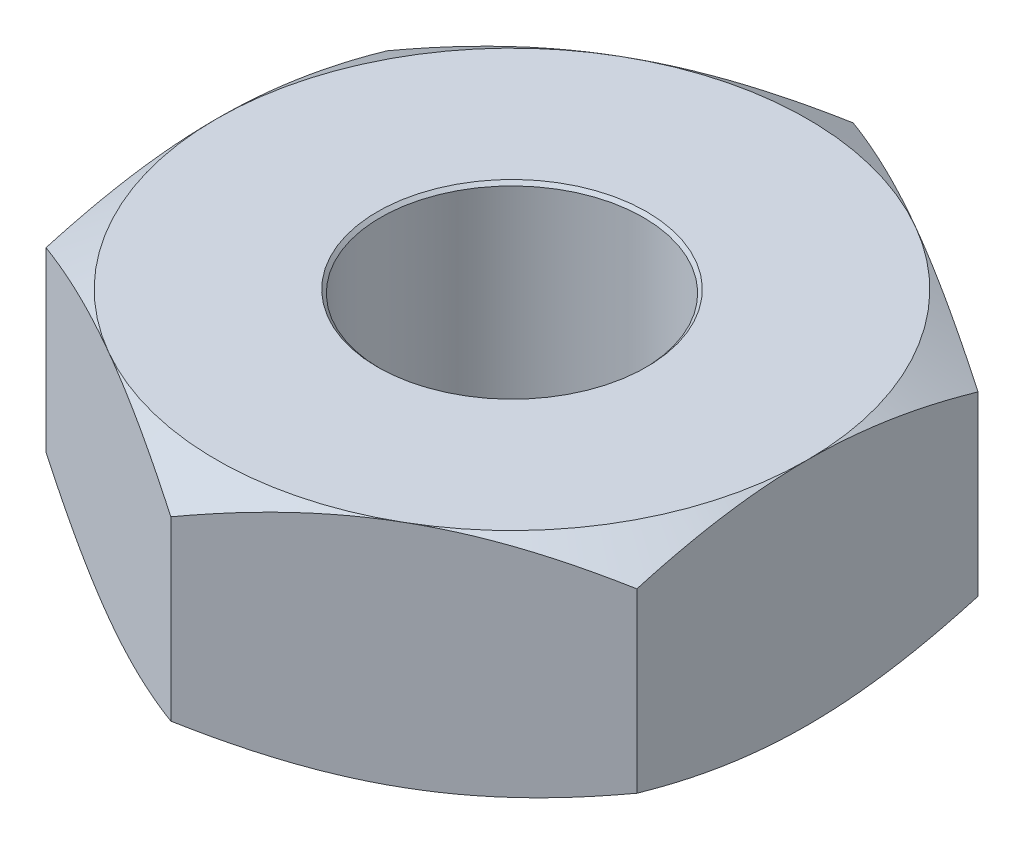
ISO-10303-21;
HEADER;
FILE_DESCRIPTION(('STEP AP214'),'2;1');
FILE_NAME('part.step','',(''),(''),'','','');
FILE_SCHEMA(('AUTOMOTIVE_DESIGN { 1 0 10303 214 1 1 1 1 }'));
ENDSEC;
DATA;
#1=APPLICATION_CONTEXT('core data for automotive mechanical design processes');
#2=APPLICATION_PROTOCOL_DEFINITION('international standard','automotive_design',2000,#1);
#3=PRODUCT_CONTEXT('',#1,'mechanical');
#4=PRODUCT('Part','Part','',(#3));
#5=PRODUCT_RELATED_PRODUCT_CATEGORY('part','',(#4));
#6=PRODUCT_DEFINITION_FORMATION('','',#4);
#7=PRODUCT_DEFINITION_CONTEXT('part definition',#1,'design');
#8=PRODUCT_DEFINITION('design','',#6,#7);
#9=PRODUCT_DEFINITION_SHAPE('','',#8);
#10=(LENGTH_UNIT() NAMED_UNIT(*) SI_UNIT(.MILLI.,.METRE.));
#11=(NAMED_UNIT(*) PLANE_ANGLE_UNIT() SI_UNIT($,.RADIAN.));
#12=(NAMED_UNIT(*) SI_UNIT($,.STERADIAN.) SOLID_ANGLE_UNIT());
#13=UNCERTAINTY_MEASURE_WITH_UNIT(LENGTH_MEASURE(1.E-05),#10,'distance_accuracy_value','');
#14=(GEOMETRIC_REPRESENTATION_CONTEXT(3) GLOBAL_UNCERTAINTY_ASSIGNED_CONTEXT((#13)) GLOBAL_UNIT_ASSIGNED_CONTEXT((#10,
#11,#12)) REPRESENTATION_CONTEXT('',''));
#15=CARTESIAN_POINT('',(0.,0.,0.));
#16=DIRECTION('',(0.,0.,1.));
#17=DIRECTION('',(1.,0.,0.));
#18=AXIS2_PLACEMENT_3D('',#15,#16,#17);
#19=CARTESIAN_POINT('',(-2.24999999999997,1.75,1.29903810567668));
#20=DIRECTION('',(0.499999999999995,0.,-0.866025403784442));
#21=DIRECTION('',(-0.866025403784442,0.,-0.499999999999995));
#22=AXIS2_PLACEMENT_3D('',#19,#20,#21);
#23=PLANE('',#22);
#24=CARTESIAN_POINT('',(0.0002,0.201028565434247,2.59819168140714));
#25=CARTESIAN_POINT('',(-0.0986772488143572,0.168055578047857,2.54110487518744));
#26=CARTESIAN_POINT('',(-0.198407997179093,0.138067535415591,2.48352530077258));
#27=CARTESIAN_POINT('',(-0.399596540220632,0.0857223882308722,2.36736904128968));
#28=CARTESIAN_POINT('',(-0.501057910502945,0.0633838027064733,2.30879029184484));
#29=CARTESIAN_POINT('',(-0.702723189801078,0.0286095576734145,2.19235878855586));
#30=CARTESIAN_POINT('',(-0.802896064976671,0.0159424738337146,2.13452395210774));
#31=CARTESIAN_POINT('',(-1.00371331260268,0.000818907417416121,2.01858206013294));
#32=CARTESIAN_POINT('',(-1.1043569548332,-0.00165009697600391,1.96047542619893));
#33=CARTESIAN_POINT('',(-1.29242516452656,0.00347837463602749,1.85189419470646));
#34=CARTESIAN_POINT('',(-1.37987784389125,0.0098166345151186,1.8014033667339));
#35=CARTESIAN_POINT('',(-1.55421343210876,0.029907657189887,1.70075066794719));
#36=CARTESIAN_POINT('',(-1.64109573768828,0.0436672872310812,1.65058914543304));
#37=CARTESIAN_POINT('',(-1.81579095410172,0.078066265350662,1.5497288152106));
#38=CARTESIAN_POINT('',(-1.90358174743524,0.0988514715826513,1.49904277704713));
#39=CARTESIAN_POINT('',(-2.07785373687757,0.146026087362973,1.39842679703038));
#40=CARTESIAN_POINT('',(-2.16433716675098,0.172404408014295,1.34849556551253));
#41=CARTESIAN_POINT('',(-2.25019999999997,0.201028565434247,1.29892263562284));
#42=B_SPLINE_CURVE_WITH_KNOTS('',3,(#24,#25,#26,#27,#28,#29,#30,#31,#32,#33,#34,#35,#36,#37,#38,
#39,#40,#41),.UNSPECIFIED.,.F.,.F.,(4,2,2,2,2,2,2,2,4),(0.,0.35665882601655,0.714175103224232,
1.06284241804968,1.41108149062515,1.71433394539792,2.0178674925822,2.32813511279242,
2.63779325460355),.UNSPECIFIED.);
#43=CARTESIAN_POINT('',(0.,0.200961894323333,2.5980762113533));
#44=VERTEX_POINT('',#43);
#45=CARTESIAN_POINT('',(-1.12499999999999,0.,1.94855715851499));
#46=VERTEX_POINT('',#45);
#47=EDGE_CURVE('E153',#44,#46,#42,.T.);
#48=ORIENTED_EDGE('',*,*,#47,.F.);
#49=DIRECTION('',(0.,-1.,0.));
#50=VECTOR('',#49,1.);
#51=CARTESIAN_POINT('',(0.,1.75,2.5980762113533));
#52=LINE('',#51,#50);
#53=CARTESIAN_POINT('',(0.,1.54903810567667,2.5980762113533));
#54=VERTEX_POINT('',#53);
#55=EDGE_CURVE('E168',#54,#44,#52,.T.);
#56=ORIENTED_EDGE('',*,*,#55,.F.);
#57=CARTESIAN_POINT('',(-2.25019999999997,1.54897143456575,1.29892263562284));
#58=CARTESIAN_POINT('',(-2.15132275118562,1.58194442195214,1.35600944184254));
#59=CARTESIAN_POINT('',(-2.05159200282088,1.61193246458441,1.4135890162574));
#60=CARTESIAN_POINT('',(-1.85040345977934,1.66427761176913,1.5297452757403));
#61=CARTESIAN_POINT('',(-1.74894208949703,1.68661619729353,1.58832402518514));
#62=CARTESIAN_POINT('',(-1.5472768101989,1.72139044232659,1.70475552847412));
#63=CARTESIAN_POINT('',(-1.4471039350233,1.73405752616629,1.76259036492224));
#64=CARTESIAN_POINT('',(-1.2462866873973,1.74918109258258,1.87853225689704));
#65=CARTESIAN_POINT('',(-1.14564304516677,1.751650096976,1.93663889083105));
#66=CARTESIAN_POINT('',(-0.957574835473412,1.74652162536397,2.04522012232352));
#67=CARTESIAN_POINT('',(-0.870122156108721,1.74018336548488,2.09571095029608));
#68=CARTESIAN_POINT('',(-0.695786567891209,1.72009234281011,2.19636364908279));
#69=CARTESIAN_POINT('',(-0.608904262311697,1.70633271276892,2.24652517159694));
#70=CARTESIAN_POINT('',(-0.434209045898254,1.67193373464934,2.34738550181938));
#71=CARTESIAN_POINT('',(-0.346418252564738,1.65114852841735,2.39807153998285));
#72=CARTESIAN_POINT('',(-0.172146263122401,1.60397391263703,2.4986875199996));
#73=CARTESIAN_POINT('',(-0.0856628332489957,1.5775955919857,2.54861875151745));
#74=CARTESIAN_POINT('',(0.000199999999999916,1.54897143456575,2.59819168140714));
#75=B_SPLINE_CURVE_WITH_KNOTS('',3,(#57,#58,#59,#60,#61,#62,#63,#64,#65,#66,#67,#68,#69,#70,#71,
#72,#73,#74),.UNSPECIFIED.,.F.,.F.,(4,2,2,2,2,2,2,2,4),(0.,0.35665882601655,0.714175103224233,
1.06284241804968,1.41108149062515,1.71433394539792,2.0178674925822,2.32813511279242,
2.63779325460355),.UNSPECIFIED.);
#76=CARTESIAN_POINT('',(-1.12499999999999,1.75,1.94855715851499));
#77=VERTEX_POINT('',#76);
#78=EDGE_CURVE('E232',#77,#54,#75,.T.);
#79=ORIENTED_EDGE('',*,*,#78,.F.);
#80=CARTESIAN_POINT('',(-2.24999999999997,1.54903810567667,1.29903810567668));
#81=VERTEX_POINT('',#80);
#82=EDGE_CURVE('E239',#81,#77,#75,.T.);
#83=ORIENTED_EDGE('',*,*,#82,.F.);
#84=DIRECTION('',(0.,-1.,0.));
#85=VECTOR('',#84,1.);
#86=CARTESIAN_POINT('',(-2.24999999999997,1.75,1.29903810567668));
#87=LINE('',#86,#85);
#88=CARTESIAN_POINT('',(-2.24999999999997,0.200961894323333,1.29903810567668));
#89=VERTEX_POINT('',#88);
#90=EDGE_CURVE('E247',#81,#89,#87,.T.);
#91=ORIENTED_EDGE('',*,*,#90,.T.);
#92=EDGE_CURVE('E221',#46,#89,#42,.T.);
#93=ORIENTED_EDGE('',*,*,#92,.F.);
#94=EDGE_LOOP('',(#48,#56,#79,#83,#91,#93));
#95=FACE_BOUND('',#94,.T.);
#96=ADVANCED_FACE('F43',(#95),#23,.F.);
#97=CARTESIAN_POINT('',(0.,1.75,2.5980762113533));
#98=DIRECTION('',(-0.500000000000001,0.,-0.866025403784438));
#99=DIRECTION('',(-0.866025403784438,0.,0.500000000000001));
#100=AXIS2_PLACEMENT_3D('',#97,#98,#99);
#101=PLANE('',#100);
#102=CARTESIAN_POINT('',(2.25019999999999,0.201028565434247,1.29892263562281));
#103=CARTESIAN_POINT('',(2.15132275118563,0.168055578047856,1.35600944184251));
#104=CARTESIAN_POINT('',(2.0515920028209,0.138067535415591,1.41358901625737));
#105=CARTESIAN_POINT('',(1.85040345977936,0.0857223882308706,1.52974527574027));
#106=CARTESIAN_POINT('',(1.74894208949705,0.0633838027064712,1.58832402518511));
#107=CARTESIAN_POINT('',(1.54727681019892,0.0286095576734114,1.70475552847409));
#108=CARTESIAN_POINT('',(1.44710393502332,0.0159424738337108,1.76259036492222));
#109=CARTESIAN_POINT('',(1.24628668739732,0.000818907417411258,1.87853225689701));
#110=CARTESIAN_POINT('',(1.1456430451668,-0.00165009697600925,1.93663889083103));
#111=CARTESIAN_POINT('',(0.957574835473434,0.00347837463602143,2.0452201223235));
#112=CARTESIAN_POINT('',(0.870122156108741,0.0098166345151125,2.09571095029606));
#113=CARTESIAN_POINT('',(0.695786567891225,0.0299076571898813,2.19636364908278));
#114=CARTESIAN_POINT('',(0.608904262311711,0.0436672872310758,2.24652517159692));
#115=CARTESIAN_POINT('',(0.434209045898263,0.0780662653506577,2.34738550181937));
#116=CARTESIAN_POINT('',(0.346418252564746,0.0988514715826477,2.39807153998285));
#117=CARTESIAN_POINT('',(0.172146263122404,0.146026087362971,2.49868751999959));
#118=CARTESIAN_POINT('',(0.0856628332489972,0.172404408014294,2.54861875151745));
#119=CARTESIAN_POINT('',(-0.000200000000000304,0.201028565434247,2.59819168140714));
#120=B_SPLINE_CURVE_WITH_KNOTS('',3,(#102,#103,#104,#105,#106,#107,#108,#109,#110,#111,#112,
#113,#114,#115,#116,#117,#118,#119),.UNSPECIFIED.,.F.,.F.,(4,2,2,2,2,2,2,2,4),(0.,
0.35665882601655,0.714175103224233,1.06284241804968,1.41108149062515,1.71433394539793,
2.01786749258221,2.32813511279244,2.63779325460359),.UNSPECIFIED.);
#121=CARTESIAN_POINT('',(2.24999999999999,0.200961894323333,1.29903810567665));
#122=VERTEX_POINT('',#121);
#123=CARTESIAN_POINT('',(1.125,0.,1.94855715851499));
#124=VERTEX_POINT('',#123);
#125=EDGE_CURVE('E132',#122,#124,#120,.T.);
#126=ORIENTED_EDGE('',*,*,#125,.F.);
#127=DIRECTION('',(0.,-1.,0.));
#128=VECTOR('',#127,1.);
#129=CARTESIAN_POINT('',(2.24999999999999,1.75,1.29903810567665));
#130=LINE('',#129,#128);
#131=CARTESIAN_POINT('',(2.24999999999999,1.54903810567667,1.29903810567665));
#132=VERTEX_POINT('',#131);
#133=EDGE_CURVE('E259',#132,#122,#130,.T.);
#134=ORIENTED_EDGE('',*,*,#133,.F.);
#135=CARTESIAN_POINT('',(-0.000200000000000074,1.54897143456575,2.59819168140714));
#136=CARTESIAN_POINT('',(0.0986772488143567,1.58194442195214,2.54110487518744));
#137=CARTESIAN_POINT('',(0.198407997179092,1.61193246458441,2.48352530077258));
#138=CARTESIAN_POINT('',(0.39959654022063,1.66427761176913,2.36736904128968));
#139=CARTESIAN_POINT('',(0.501057910502942,1.68661619729353,2.30879029184484));
#140=CARTESIAN_POINT('',(0.702723189801074,1.72139044232659,2.19235878855586));
#141=CARTESIAN_POINT('',(0.802896064976667,1.73405752616629,2.13452395210773));
#142=CARTESIAN_POINT('',(1.00371331260267,1.74918109258259,2.01858206013294));
#143=CARTESIAN_POINT('',(1.10435695483319,1.75165009697601,1.96047542619892));
#144=CARTESIAN_POINT('',(1.29242516452656,1.74652162536398,1.85189419470645));
#145=CARTESIAN_POINT('',(1.37987784389125,1.74018336548489,1.80140336673389));
#146=CARTESIAN_POINT('',(1.55421343210877,1.72009234281012,1.70075066794717));
#147=CARTESIAN_POINT('',(1.64109573768828,1.70633271276892,1.65058914543302));
#148=CARTESIAN_POINT('',(1.81579095410173,1.67193373464934,1.54972881521058));
#149=CARTESIAN_POINT('',(1.90358174743524,1.65114852841735,1.4990427770471));
#150=CARTESIAN_POINT('',(2.07785373687759,1.60397391263703,1.39842679703035));
#151=CARTESIAN_POINT('',(2.16433716675099,1.57759559198571,1.3484955655125));
#152=CARTESIAN_POINT('',(2.25019999999999,1.54897143456575,1.29892263562281));
#153=B_SPLINE_CURVE_WITH_KNOTS('',3,(#135,#136,#137,#138,#139,#140,#141,#142,#143,#144,#145,
#146,#147,#148,#149,#150,#151,#152),.UNSPECIFIED.,.F.,.F.,(4,2,2,2,2,2,2,2,4),(0.,
0.35665882601655,0.714175103224232,1.06284241804968,1.41108149062515,1.71433394539793,
2.01786749258221,2.32813511279244,2.63779325460359),.UNSPECIFIED.);
#154=CARTESIAN_POINT('',(1.125,1.75,1.94855715851497));
#155=VERTEX_POINT('',#154);
#156=EDGE_CURVE('E241',#155,#132,#153,.T.);
#157=ORIENTED_EDGE('',*,*,#156,.F.);
#158=EDGE_CURVE('E240',#54,#155,#153,.T.);
#159=ORIENTED_EDGE('',*,*,#158,.F.);
#160=ORIENTED_EDGE('',*,*,#55,.T.);
#161=EDGE_CURVE('E145',#124,#44,#120,.T.);
#162=ORIENTED_EDGE('',*,*,#161,.F.);
#163=EDGE_LOOP('',(#126,#134,#157,#159,#160,#162));
#164=FACE_BOUND('',#163,.T.);
#165=ADVANCED_FACE('F165',(#164),#101,.F.);
#166=CARTESIAN_POINT('',(2.24999999999999,1.75,1.29903810567665));
#167=DIRECTION('',(-1.,0.,0.));
#168=DIRECTION('',(0.,0.,1.));
#169=AXIS2_PLACEMENT_3D('',#166,#167,#168);
#170=PLANE('',#169);
#171=CARTESIAN_POINT('',(2.24999999999997,1.12189345440879,-3.53839354168716));
#172=CARTESIAN_POINT('',(2.24999999999997,1.07381689263271,-3.43968702230924));
#173=CARTESIAN_POINT('',(2.24999999999997,1.02618738662809,-3.34075908734806));
#174=CARTESIAN_POINT('',(2.24999999999998,0.932073016159549,-3.14234279687417));
#175=CARTESIAN_POINT('',(2.24999999999998,0.885588323028845,-3.04285436018147));
#176=CARTESIAN_POINT('',(2.24999999999998,0.793790693187942,-2.84271015577662));
#177=CARTESIAN_POINT('',(2.24999999999998,0.748485099940266,-2.74205100864245));
#178=CARTESIAN_POINT('',(2.24999999999998,0.659663985324698,-2.53994893284405));
#179=CARTESIAN_POINT('',(2.24999999999998,0.616148382486699,-2.43850604010161));
#180=CARTESIAN_POINT('',(2.24999999999998,0.529951137913691,-2.23124359203539));
#181=CARTESIAN_POINT('',(2.24999999999998,0.487346902181633,-2.12539167338407));
#182=CARTESIAN_POINT('',(2.24999999999998,0.405245804089762,-1.91246771968394));
#183=CARTESIAN_POINT('',(2.24999999999998,0.365749283405793,-1.80539555195302));
#184=CARTESIAN_POINT('',(2.24999999999998,0.290864517372069,-1.59004569346553));
#185=CARTESIAN_POINT('',(2.24999999999998,0.255468368389612,-1.48177077815462));
#186=CARTESIAN_POINT('',(2.24999999999998,0.189887529477515,-1.26366853351124));
#187=CARTESIAN_POINT('',(2.24999999999998,0.15970124962558,-1.15384168889745));
#188=CARTESIAN_POINT('',(2.24999999999998,0.106115988937838,-0.933179524691479));
#189=CARTESIAN_POINT('',(2.24999999999998,0.0826792213152491,-0.822353549743366));
#190=CARTESIAN_POINT('',(2.24999999999998,0.0438866636506034,-0.599273570543113));
#191=CARTESIAN_POINT('',(2.24999999999998,0.0285300017443114,-0.487019721701504));
#192=CARTESIAN_POINT('',(2.24999999999999,0.00732134437037383,-0.263130818473846));
#193=CARTESIAN_POINT('',(2.24999999999999,0.00134332663237845,-0.151508003795488));
#194=CARTESIAN_POINT('',(2.24999999999999,-0.000936284764426156,0.0718484062996929));
#195=CARTESIAN_POINT('',(2.24999999999999,0.00276227423309439,0.183582003436407));
#196=CARTESIAN_POINT('',(2.24999999999999,0.0168788328783875,0.371822826821483));
#197=CARTESIAN_POINT('',(2.24999999999999,0.0248616867557757,0.448525129865842));
#198=CARTESIAN_POINT('',(2.24999999999999,0.0449163776446814,0.601398348033987));
#199=CARTESIAN_POINT('',(2.24999999999999,0.0569887285740803,0.677569195142451));
#200=CARTESIAN_POINT('',(2.24999999999999,0.0987103717056496,0.905153855162318));
#201=CARTESIAN_POINT('',(2.24999999999999,0.133857793287038,1.05556400492303));
#202=CARTESIAN_POINT('',(2.24999999999999,0.215919885548329,1.35680852161716));
#203=CARTESIAN_POINT('',(2.24999999999999,0.263090938580733,1.5075702774342));
#204=CARTESIAN_POINT('',(2.24999999999999,0.339802085098616,1.73161049986243));
#205=CARTESIAN_POINT('',(2.24999999999999,0.366362625537712,1.80593454194757));
#206=CARTESIAN_POINT('',(2.24999999999999,0.421158989940176,1.95396145865595));
#207=CARTESIAN_POINT('',(2.24999999999999,0.449394776403708,2.02766434714137));
#208=CARTESIAN_POINT('',(2.24999999999999,0.527171372756205,2.22505032637719));
#209=CARTESIAN_POINT('',(2.24999999999999,0.578001808570474,2.34822421197225));
#210=CARTESIAN_POINT('',(2.25,0.682625518133925,2.59331188339526));
#211=CARTESIAN_POINT('',(2.25,0.736419105236454,2.71522553432805));
#212=CARTESIAN_POINT('',(2.25,0.846268378663506,2.95807643433748));
#213=CARTESIAN_POINT('',(2.25,0.90232483610627,3.07901333342826));
#214=CARTESIAN_POINT('',(2.25,1.0161709877414,3.32007010456904));
#215=CARTESIAN_POINT('',(2.25,1.07396073407334,3.44018995190748));
#216=CARTESIAN_POINT('',(2.25,1.24952088573151,3.79993711773053));
#217=CARTESIAN_POINT('',(2.25,1.36930993606161,4.03857803401961));
#218=CARTESIAN_POINT('',(2.25,1.61226693923144,4.51405815321574));
#219=CARTESIAN_POINT('',(2.25,1.73543419277131,4.75089771623574));
#220=CARTESIAN_POINT('',(2.25,1.97102942460597,5.19856341283825));
#221=CARTESIAN_POINT('',(2.25000000000001,2.08322765871285,5.40951066425596));
#222=CARTESIAN_POINT('',(2.25000000000001,2.30897975973365,5.83069376778987));
#223=CARTESIAN_POINT('',(2.25000000000001,2.42253370840339,6.04092957601152));
#224=CARTESIAN_POINT('',(2.25000000000001,2.65026914188523,6.46015664385467));
#225=CARTESIAN_POINT('',(2.25000000000001,2.76444729048546,6.66914971794764));
#226=CARTESIAN_POINT('',(2.25000000000001,2.99357534595144,7.08669136434773));
#227=CARTESIAN_POINT('',(2.25000000000001,3.10852519197529,7.29523997002844));
#228=CARTESIAN_POINT('',(2.25000000000001,3.22375587580559,7.50363220026119));
#229=B_SPLINE_CURVE_WITH_KNOTS('',3,(#171,#172,#173,#174,#175,#176,#177,#178,#179,#180,#181,
#182,#183,#184,#185,#186,#187,#188,#189,#190,#191,#192,#193,#194,#195,#196,#197,#198,#199,#200,
#201,#202,#203,#204,#205,#206,#207,#208,#209,#210,#211,#212,#213,#214,#215,#216,#217,#218,#219,
#220,#221,#222,#223,#224,#225,#226,#227,#228),.UNSPECIFIED.,.F.,.F.,(4,2,2,2,2,2,2,2,2,2,2,2,2,
2,2,2,2,2,2,2,2,2,2,2,2,2,2,2,4),(0.,0.329380472235185,0.658809943772019,0.989951131456091,
1.32107723077628,1.66335183979109,2.00566402755003,2.3473050112902,2.68884154964647,
3.02842709235433,3.36797598538851,3.70292198982515,4.03787327835528,4.26911278952257,
4.50038137082525,4.96314563151469,5.43675110565364,5.67351746013594,5.91027851667872,
6.30997151319744,6.7097068587137,7.10957959135647,7.50946436477794,8.31046895155574,
9.11130896070854,9.82808994405625,10.5449143731561,11.2593583460016,11.97374663738),.UNSPECIFIED.);
#230=CARTESIAN_POINT('',(2.24999999999998,0.200961894323333,-1.29903810567666));
#231=VERTEX_POINT('',#230);
#232=CARTESIAN_POINT('',(2.25,0.,0.));
#233=VERTEX_POINT('',#232);
#234=EDGE_CURVE('E58',#231,#233,#229,.T.);
#235=ORIENTED_EDGE('',*,*,#234,.F.);
#236=DIRECTION('',(0.,-1.,0.));
#237=VECTOR('',#236,1.);
#238=CARTESIAN_POINT('',(2.24999999999998,1.75,-1.29903810567666));
#239=LINE('',#238,#237);
#240=CARTESIAN_POINT('',(2.24999999999998,1.54903810567667,-1.29903810567666));
#241=VERTEX_POINT('',#240);
#242=EDGE_CURVE('E256',#241,#231,#239,.T.);
#243=ORIENTED_EDGE('',*,*,#242,.F.);
#244=CARTESIAN_POINT('',(2.24999999999997,0.628106545591214,-3.53839354168716));
#245=CARTESIAN_POINT('',(2.24999999999997,0.676183107367294,-3.43968702230924));
#246=CARTESIAN_POINT('',(2.24999999999997,0.723812613371908,-3.34075908734806));
#247=CARTESIAN_POINT('',(2.24999999999998,0.817926983840451,-3.14234279687417));
#248=CARTESIAN_POINT('',(2.24999999999998,0.864411676971154,-3.04285436018147));
#249=CARTESIAN_POINT('',(2.24999999999998,0.956209306812058,-2.84271015577662));
#250=CARTESIAN_POINT('',(2.24999999999998,1.00151490005973,-2.74205100864245));
#251=CARTESIAN_POINT('',(2.24999999999998,1.0903360146753,-2.53994893284405));
#252=CARTESIAN_POINT('',(2.24999999999998,1.1338516175133,-2.43850604010161));
#253=CARTESIAN_POINT('',(2.24999999999998,1.22004886208631,-2.23124359203539));
#254=CARTESIAN_POINT('',(2.24999999999998,1.26265309781837,-2.12539167338407));
#255=CARTESIAN_POINT('',(2.24999999999998,1.34475419591024,-1.91246771968394));
#256=CARTESIAN_POINT('',(2.24999999999998,1.38425071659421,-1.80539555195302));
#257=CARTESIAN_POINT('',(2.24999999999998,1.45913548262793,-1.59004569346553));
#258=CARTESIAN_POINT('',(2.24999999999998,1.49453163161039,-1.48177077815462));
#259=CARTESIAN_POINT('',(2.24999999999998,1.56011247052248,-1.26366853351124));
#260=CARTESIAN_POINT('',(2.24999999999998,1.59029875037442,-1.15384168889745));
#261=CARTESIAN_POINT('',(2.24999999999998,1.64388401106216,-0.933179524691479));
#262=CARTESIAN_POINT('',(2.24999999999998,1.66732077868475,-0.822353549743367));
#263=CARTESIAN_POINT('',(2.24999999999998,1.7061133363494,-0.599273570543113));
#264=CARTESIAN_POINT('',(2.24999999999998,1.72146999825569,-0.487019721701504));
#265=CARTESIAN_POINT('',(2.24999999999999,1.74267865562963,-0.263130818473846));
#266=CARTESIAN_POINT('',(2.24999999999999,1.74865667336762,-0.151508003795487));
#267=CARTESIAN_POINT('',(2.24999999999999,1.75093628476443,0.0718484062996932));
#268=CARTESIAN_POINT('',(2.24999999999999,1.74723772576691,0.183582003436407));
#269=CARTESIAN_POINT('',(2.24999999999999,1.73312116712161,0.371822826821484));
#270=CARTESIAN_POINT('',(2.24999999999999,1.72513831324422,0.448525129865842));
#271=CARTESIAN_POINT('',(2.24999999999999,1.70508362235532,0.601398348033987));
#272=CARTESIAN_POINT('',(2.24999999999999,1.69301127142592,0.677569195142451));
#273=CARTESIAN_POINT('',(2.24999999999999,1.65128962829435,0.905153855162319));
#274=CARTESIAN_POINT('',(2.24999999999999,1.61614220671296,1.05556400492303));
#275=CARTESIAN_POINT('',(2.24999999999999,1.53408011445167,1.35680852161716));
#276=CARTESIAN_POINT('',(2.24999999999999,1.48690906141927,1.5075702774342));
#277=CARTESIAN_POINT('',(2.24999999999999,1.41019791490138,1.73161049986243));
#278=CARTESIAN_POINT('',(2.24999999999999,1.38363737446229,1.80593454194757));
#279=CARTESIAN_POINT('',(2.24999999999999,1.32884101005982,1.95396145865595));
#280=CARTESIAN_POINT('',(2.24999999999999,1.30060522359629,2.02766434714137));
#281=CARTESIAN_POINT('',(2.24999999999999,1.22282862724379,2.22505032637719));
#282=CARTESIAN_POINT('',(2.24999999999999,1.17199819142953,2.34822421197225));
#283=CARTESIAN_POINT('',(2.25,1.06737448186607,2.59331188339526));
#284=CARTESIAN_POINT('',(2.25,1.01358089476355,2.71522553432805));
#285=CARTESIAN_POINT('',(2.25,0.903731621336493,2.95807643433748));
#286=CARTESIAN_POINT('',(2.25,0.847675163893729,3.07901333342826));
#287=CARTESIAN_POINT('',(2.25,0.733829012258603,3.32007010456905));
#288=CARTESIAN_POINT('',(2.25,0.676039265926662,3.44018995190748));
#289=CARTESIAN_POINT('',(2.25,0.500479114268488,3.79993711773053));
#290=CARTESIAN_POINT('',(2.25,0.380690063938385,4.03857803401961));
#291=CARTESIAN_POINT('',(2.25,0.137733060768556,4.51405815321575));
#292=CARTESIAN_POINT('',(2.25,0.0145658072286846,4.75089771623575));
#293=CARTESIAN_POINT('',(2.25,-0.221029424605968,5.19856341283826));
#294=CARTESIAN_POINT('',(2.25000000000001,-0.333227658712853,5.40951066425597));
#295=CARTESIAN_POINT('',(2.25000000000001,-0.558979759733647,5.83069376778987));
#296=CARTESIAN_POINT('',(2.25000000000001,-0.672533708403394,6.04092957601152));
#297=CARTESIAN_POINT('',(2.25000000000001,-0.900269141885229,6.46015664385467));
#298=CARTESIAN_POINT('',(2.25000000000001,-1.01444729048546,6.66914971794764));
#299=CARTESIAN_POINT('',(2.25000000000001,-1.24357534595144,7.08669136434773));
#300=CARTESIAN_POINT('',(2.25000000000001,-1.3585251919753,7.29523997002844));
#301=CARTESIAN_POINT('',(2.25000000000001,-1.47375587580559,7.50363220026119));
#302=B_SPLINE_CURVE_WITH_KNOTS('',3,(#244,#245,#246,#247,#248,#249,#250,#251,#252,#253,#254,
#255,#256,#257,#258,#259,#260,#261,#262,#263,#264,#265,#266,#267,#268,#269,#270,#271,#272,#273,
#274,#275,#276,#277,#278,#279,#280,#281,#282,#283,#284,#285,#286,#287,#288,#289,#290,#291,#292,
#293,#294,#295,#296,#297,#298,#299,#300,#301),.UNSPECIFIED.,.F.,.F.,(4,2,2,2,2,2,2,2,2,2,2,2,2,
2,2,2,2,2,2,2,2,2,2,2,2,2,2,2,4),(0.,0.329380472235185,0.658809943772019,0.98995113145609,
1.32107723077628,1.66335183979109,2.00566402755003,2.3473050112902,2.68884154964647,
3.02842709235433,3.36797598538851,3.70292198982515,4.03787327835528,4.26911278952257,
4.50038137082525,4.96314563151469,5.43675110565365,5.67351746013595,5.91027851667872,
6.30997151319744,6.7097068587137,7.10957959135647,7.50946436477794,8.31046895155574,
9.11130896070854,9.82808994405626,10.5449143731561,11.2593583460016,11.97374663738),.UNSPECIFIED.);
#303=CARTESIAN_POINT('',(2.24999999999999,1.75,0.));
#304=VERTEX_POINT('',#303);
#305=EDGE_CURVE('E297',#304,#241,#302,.F.);
#306=ORIENTED_EDGE('',*,*,#305,.F.);
#307=EDGE_CURVE('E302',#132,#304,#302,.F.);
#308=ORIENTED_EDGE('',*,*,#307,.F.);
#309=ORIENTED_EDGE('',*,*,#133,.T.);
#310=EDGE_CURVE('E139',#233,#122,#229,.T.);
#311=ORIENTED_EDGE('',*,*,#310,.F.);
#312=EDGE_LOOP('',(#235,#243,#306,#308,#309,#311));
#313=FACE_BOUND('',#312,.T.);
#314=ADVANCED_FACE('F303',(#313),#170,.F.);
#315=CARTESIAN_POINT('',(2.24999999999998,1.75,-1.29903810567666));
#316=DIRECTION('',(-0.499999999999995,0.,0.866025403784442));
#317=DIRECTION('',(0.866025403784442,0.,0.499999999999995));
#318=AXIS2_PLACEMENT_3D('',#315,#316,#317);
#319=PLANE('',#318);
#320=CARTESIAN_POINT('',(-0.00020000000001803,0.201028565434247,-2.59819168140714));
#321=CARTESIAN_POINT('',(0.098677248814339,0.168055578047856,-2.54110487518744));
#322=CARTESIAN_POINT('',(0.198407997179075,0.13806753541559,-2.48352530077258));
#323=CARTESIAN_POINT('',(0.399596540220614,0.0857223882308705,-2.36736904128968));
#324=CARTESIAN_POINT('',(0.501057910502926,0.0633838027064712,-2.30879029184484));
#325=CARTESIAN_POINT('',(0.702723189801059,0.0286095576734113,-2.19235878855586));
#326=CARTESIAN_POINT('',(0.802896064976652,0.0159424738337109,-2.13452395210774));
#327=CARTESIAN_POINT('',(1.00371331260266,0.00081890741741132,-2.01858206013294));
#328=CARTESIAN_POINT('',(1.10435695483318,-0.00165009697600918,-1.96047542619893));
#329=CARTESIAN_POINT('',(1.29242516452654,0.00347837463602137,-1.85189419470645));
#330=CARTESIAN_POINT('',(1.37987784389124,0.00981663451511229,-1.8014033667339));
#331=CARTESIAN_POINT('',(1.55421343210875,0.0299076571898809,-1.70075066794718));
#332=CARTESIAN_POINT('',(1.64109573768827,0.0436672872310755,-1.65058914543304));
#333=CARTESIAN_POINT('',(1.81579095410172,0.0780662653506576,-1.54972881521059));
#334=CARTESIAN_POINT('',(1.90358174743524,0.0988514715826477,-1.49904277704712));
#335=CARTESIAN_POINT('',(2.07785373687758,0.146026087362972,-1.39842679703037));
#336=CARTESIAN_POINT('',(2.16433716675098,0.172404408014294,-1.34849556551252));
#337=CARTESIAN_POINT('',(2.25019999999998,0.201028565434247,-1.29892263562282));
#338=B_SPLINE_CURVE_WITH_KNOTS('',3,(#320,#321,#322,#323,#324,#325,#326,#327,#328,#329,#330,
#331,#332,#333,#334,#335,#336,#337),.UNSPECIFIED.,.F.,.F.,(4,2,2,2,2,2,2,2,4),(0.,
0.35665882601655,0.714175103224232,1.06284241804968,1.41108149062515,1.71433394539793,
2.01786749258221,2.32813511279244,2.63779325460359),.UNSPECIFIED.);
#339=CARTESIAN_POINT('',(0.,0.200961894323333,-2.5980762113533));
#340=VERTEX_POINT('',#339);
#341=CARTESIAN_POINT('',(1.12499999999999,0.,-1.94855715851499));
#342=VERTEX_POINT('',#341);
#343=EDGE_CURVE('E66',#340,#342,#338,.T.);
#344=ORIENTED_EDGE('',*,*,#343,.F.);
#345=DIRECTION('',(0.,-1.,0.));
#346=VECTOR('',#345,1.);
#347=CARTESIAN_POINT('',(0.,1.75,-2.5980762113533));
#348=LINE('',#347,#346);
#349=CARTESIAN_POINT('',(0.,1.54903810567667,-2.5980762113533));
#350=VERTEX_POINT('',#349);
#351=EDGE_CURVE('E253',#350,#340,#348,.T.);
#352=ORIENTED_EDGE('',*,*,#351,.F.);
#353=CARTESIAN_POINT('',(2.25019999999998,1.54897143456575,-1.29892263562282));
#354=CARTESIAN_POINT('',(2.15132275118563,1.58194442195214,-1.35600944184252));
#355=CARTESIAN_POINT('',(2.05159200282089,1.61193246458441,-1.41358901625738));
#356=CARTESIAN_POINT('',(1.85040345977935,1.66427761176913,-1.52974527574028));
#357=CARTESIAN_POINT('',(1.74894208949704,1.68661619729353,-1.58832402518512));
#358=CARTESIAN_POINT('',(1.54727681019891,1.72139044232659,-1.7047555284741));
#359=CARTESIAN_POINT('',(1.44710393502331,1.73405752616629,-1.76259036492223));
#360=CARTESIAN_POINT('',(1.24628668739731,1.74918109258259,-1.87853225689702));
#361=CARTESIAN_POINT('',(1.14564304516678,1.75165009697601,-1.93663889083104));
#362=CARTESIAN_POINT('',(0.957574835473419,1.74652162536398,-2.04522012232351));
#363=CARTESIAN_POINT('',(0.870122156108726,1.74018336548489,-2.09571095029607));
#364=CARTESIAN_POINT('',(0.69578656789121,1.72009234281012,-2.19636364908278));
#365=CARTESIAN_POINT('',(0.608904262311695,1.70633271276892,-2.24652517159693));
#366=CARTESIAN_POINT('',(0.434209045898247,1.67193373464934,-2.34738550181937));
#367=CARTESIAN_POINT('',(0.346418252564729,1.65114852841735,-2.39807153998285));
#368=CARTESIAN_POINT('',(0.172146263122387,1.60397391263703,-2.49868751999959));
#369=CARTESIAN_POINT('',(0.0856628332489798,1.57759559198571,-2.54861875151745));
#370=CARTESIAN_POINT('',(-0.000200000000018127,1.54897143456575,-2.59819168140714));
#371=B_SPLINE_CURVE_WITH_KNOTS('',3,(#353,#354,#355,#356,#357,#358,#359,#360,#361,#362,#363,
#364,#365,#366,#367,#368,#369,#370),.UNSPECIFIED.,.F.,.F.,(4,2,2,2,2,2,2,2,4),(0.,
0.35665882601655,0.714175103224232,1.06284241804968,1.41108149062515,1.71433394539793,
2.01786749258221,2.32813511279244,2.63779325460359),.UNSPECIFIED.);
#372=CARTESIAN_POINT('',(1.12499999999998,1.75,-1.94855715851498));
#373=VERTEX_POINT('',#372);
#374=EDGE_CURVE('E291',#373,#350,#371,.T.);
#375=ORIENTED_EDGE('',*,*,#374,.F.);
#376=EDGE_CURVE('E296',#241,#373,#371,.T.);
#377=ORIENTED_EDGE('',*,*,#376,.F.);
#378=ORIENTED_EDGE('',*,*,#242,.T.);
#379=EDGE_CURVE('E144',#342,#231,#338,.T.);
#380=ORIENTED_EDGE('',*,*,#379,.F.);
#381=EDGE_LOOP('',(#344,#352,#375,#377,#378,#380));
#382=FACE_BOUND('',#381,.T.);
#383=ADVANCED_FACE('F278',(#382),#319,.F.);
#384=CARTESIAN_POINT('',(0.,1.75,-2.5980762113533));
#385=DIRECTION('',(0.500000000000007,0.,0.866025403784435));
#386=DIRECTION('',(0.866025403784435,0.,-0.500000000000007));
#387=AXIS2_PLACEMENT_3D('',#384,#385,#386);
#388=PLANE('',#387);
#389=CARTESIAN_POINT('',(-2.2502,0.201028565434247,-1.29892263562279));
#390=CARTESIAN_POINT('',(-2.15132275118564,0.168055578047856,-1.35600944184249));
#391=CARTESIAN_POINT('',(-2.05159200282091,0.13806753541559,-1.41358901625736));
#392=CARTESIAN_POINT('',(-1.85040345977937,0.0857223882308707,-1.52974527574026));
#393=CARTESIAN_POINT('',(-1.74894208949706,0.0633838027064715,-1.5883240251851));
#394=CARTESIAN_POINT('',(-1.54727681019893,0.0286095576734117,-1.70475552847408));
#395=CARTESIAN_POINT('',(-1.44710393502334,0.0159424738337111,-1.76259036492221));
#396=CARTESIAN_POINT('',(-1.24628668739733,0.000818907417411473,-1.878532256897));
#397=CARTESIAN_POINT('',(-1.14564304516681,-0.00165009697600904,-1.93663889083102));
#398=CARTESIAN_POINT('',(-0.957574835473448,0.0034783746360216,-2.0452201223235));
#399=CARTESIAN_POINT('',(-0.870122156108755,0.00981663451511261,-2.09571095029606));
#400=CARTESIAN_POINT('',(-0.69578656789124,0.0299076571898812,-2.19636364908277));
#401=CARTESIAN_POINT('',(-0.608904262311727,0.0436672872310757,-2.24652517159692));
#402=CARTESIAN_POINT('',(-0.43420904589828,0.0780662653506576,-2.34738550181937));
#403=CARTESIAN_POINT('',(-0.346418252564763,0.0988514715826476,-2.39807153998284));
#404=CARTESIAN_POINT('',(-0.172146263122422,0.146026087362971,-2.49868751999959));
#405=CARTESIAN_POINT('',(-0.0856628332490152,0.172404408014294,-2.54861875151745));
#406=CARTESIAN_POINT('',(0.000199999999981999,0.201028565434247,-2.59819168140714));
#407=B_SPLINE_CURVE_WITH_KNOTS('',3,(#389,#390,#391,#392,#393,#394,#395,#396,#397,#398,#399,
#400,#401,#402,#403,#404,#405,#406),.UNSPECIFIED.,.F.,.F.,(4,2,2,2,2,2,2,2,4),(0.,
0.35665882601655,0.714175103224232,1.06284241804968,1.41108149062515,1.71433394539793,
2.01786749258221,2.32813511279244,2.63779325460359),.UNSPECIFIED.);
#408=CARTESIAN_POINT('',(-2.25,0.200961894323256,-1.29903810567675));
#409=VERTEX_POINT('',#408);
#410=CARTESIAN_POINT('',(-1.12500000000002,0.,-1.94855715851498));
#411=VERTEX_POINT('',#410);
#412=EDGE_CURVE('E215',#409,#411,#407,.T.);
#413=ORIENTED_EDGE('',*,*,#412,.F.);
#414=DIRECTION('',(0.,-1.,0.));
#415=VECTOR('',#414,1.);
#416=CARTESIAN_POINT('',(-2.25,1.75,-1.29903810567663));
#417=LINE('',#416,#415);
#418=CARTESIAN_POINT('',(-2.25,1.54903810567674,-1.29903810567675));
#419=VERTEX_POINT('',#418);
#420=EDGE_CURVE('E250',#419,#409,#417,.T.);
#421=ORIENTED_EDGE('',*,*,#420,.F.);
#422=CARTESIAN_POINT('',(0.000199999999981931,1.54897143456575,-2.59819168140714));
#423=CARTESIAN_POINT('',(-0.0986772488143744,1.58194442195214,-2.54110487518744));
#424=CARTESIAN_POINT('',(-0.19840799717911,1.61193246458441,-2.48352530077258));
#425=CARTESIAN_POINT('',(-0.399596540220647,1.66427761176913,-2.36736904128967));
#426=CARTESIAN_POINT('',(-0.501057910502958,1.68661619729353,-2.30879029184483));
#427=CARTESIAN_POINT('',(-0.70272318980109,1.72139044232659,-2.19235878855585));
#428=CARTESIAN_POINT('',(-0.802896064976682,1.73405752616629,-2.13452395210773));
#429=CARTESIAN_POINT('',(-1.00371331260269,1.74918109258259,-2.01858206013293));
#430=CARTESIAN_POINT('',(-1.10435695483321,1.75165009697601,-1.96047542619891));
#431=CARTESIAN_POINT('',(-1.29242516452657,1.74652162536398,-1.85189419470644));
#432=CARTESIAN_POINT('',(-1.37987784389126,1.74018336548489,-1.80140336673388));
#433=CARTESIAN_POINT('',(-1.55421343210878,1.72009234281012,-1.70075066794716));
#434=CARTESIAN_POINT('',(-1.64109573768829,1.70633271276892,-1.65058914543301));
#435=CARTESIAN_POINT('',(-1.81579095410174,1.67193373464934,-1.54972881521057));
#436=CARTESIAN_POINT('',(-1.90358174743526,1.65114852841735,-1.49904277704709));
#437=CARTESIAN_POINT('',(-2.0778537368776,1.60397391263703,-1.39842679703034));
#438=CARTESIAN_POINT('',(-2.164337166751,1.57759559198571,-1.34849556551249));
#439=CARTESIAN_POINT('',(-2.2502,1.54897143456575,-1.29892263562279));
#440=B_SPLINE_CURVE_WITH_KNOTS('',3,(#422,#423,#424,#425,#426,#427,#428,#429,#430,#431,#432,
#433,#434,#435,#436,#437,#438,#439),.UNSPECIFIED.,.F.,.F.,(4,2,2,2,2,2,2,2,4),(0.,
0.35665882601655,0.714175103224233,1.06284241804968,1.41108149062515,1.71433394539793,
2.01786749258221,2.32813511279244,2.63779325460359),.UNSPECIFIED.);
#441=CARTESIAN_POINT('',(-1.12500000000001,1.75,-1.94855715851497));
#442=VERTEX_POINT('',#441);
#443=EDGE_CURVE('E283',#442,#419,#440,.T.);
#444=ORIENTED_EDGE('',*,*,#443,.F.);
#445=EDGE_CURVE('E289',#350,#442,#440,.T.);
#446=ORIENTED_EDGE('',*,*,#445,.F.);
#447=ORIENTED_EDGE('',*,*,#351,.T.);
#448=EDGE_CURVE('E169',#411,#340,#407,.T.);
#449=ORIENTED_EDGE('',*,*,#448,.F.);
#450=EDGE_LOOP('',(#413,#421,#444,#446,#447,#449));
#451=FACE_BOUND('',#450,.T.);
#452=ADVANCED_FACE('F272',(#451),#388,.F.);
#453=CARTESIAN_POINT('',(-2.25,1.75,-1.29903810567663));
#454=DIRECTION('',(1.,0.,0.));
#455=DIRECTION('',(0.,0.,-1.));
#456=AXIS2_PLACEMENT_3D('',#453,#454,#455);
#457=PLANE('',#456);
#458=CARTESIAN_POINT('',(-2.25000000000002,1.12189345527265,-3.53839354346027));
#459=CARTESIAN_POINT('',(-2.25000000000002,1.07381689346056,-3.43968702402266));
#460=CARTESIAN_POINT('',(-2.25000000000002,1.02618738741996,-3.34075908900174));
#461=CARTESIAN_POINT('',(-2.25000000000002,0.932073016879612,-3.14234279840819));
#462=CARTESIAN_POINT('',(-2.25000000000002,0.885588323713093,-3.04285436165557));
#463=CARTESIAN_POINT('',(-2.25000000000002,0.79379069380054,-2.84271015712998));
#464=CARTESIAN_POINT('',(-2.25000000000002,0.748485100517036,-2.74205100993498));
#465=CARTESIAN_POINT('',(-2.25000000000001,0.659663985830404,-2.53994893401452));
#466=CARTESIAN_POINT('',(-2.25000000000001,0.616148382957167,-2.43850604121085));
#467=CARTESIAN_POINT('',(-2.25000000000001,0.529951138312623,-2.23124359301733));
#468=CARTESIAN_POINT('',(-2.25000000000001,0.487346902544349,-2.12539167429992));
#469=CARTESIAN_POINT('',(-2.25000000000001,0.405245804381964,-1.91246772046654));
#470=CARTESIAN_POINT('',(-2.25000000000001,0.365749283663698,-1.80539555266846));
#471=CARTESIAN_POINT('',(-2.25,0.290864517564634,-1.59004569404542));
#472=CARTESIAN_POINT('',(-2.25,0.255468368551124,-1.48177077866612));
#473=CARTESIAN_POINT('',(-2.25,0.189887529581946,-1.2636685338841));
#474=CARTESIAN_POINT('',(-2.25,0.159701249703978,-1.15384168920007));
#475=CARTESIAN_POINT('',(-2.25,0.106115988963659,-0.933179524817828));
#476=CARTESIAN_POINT('',(-2.25,0.0826792213165055,-0.822353549763202));
#477=CARTESIAN_POINT('',(-2.24999999999999,0.0438866636187554,-0.599273570347322));
#478=CARTESIAN_POINT('',(-2.24999999999999,0.0285300017039113,-0.487019721396602));
#479=CARTESIAN_POINT('',(-2.24999999999999,0.00732134433234053,-0.263130817952508));
#480=CARTESIAN_POINT('',(-2.24999999999999,0.00134332660490107,-0.151508003166847));
#481=CARTESIAN_POINT('',(-2.24999999999999,-0.000936284751972795,0.0718484071413361));
#482=CARTESIAN_POINT('',(-2.24999999999998,0.00276227427492716,0.18358200438375));
#483=CARTESIAN_POINT('',(-2.24999999999998,0.0168788329795992,0.371822827901109));
#484=CARTESIAN_POINT('',(-2.24999999999998,0.024861686880486,0.448525130973248));
#485=CARTESIAN_POINT('',(-2.24999999999998,0.0449163778176305,0.601398349195699));
#486=CARTESIAN_POINT('',(-2.24999999999998,0.0569887287717698,0.677569196330688));
#487=CARTESIAN_POINT('',(-2.24999999999998,0.0987103719780744,0.905153856428665));
#488=CARTESIAN_POINT('',(-2.24999999999998,0.133857793609941,1.05556400623937));
#489=CARTESIAN_POINT('',(-2.24999999999997,0.215919885970974,1.35680852303399));
#490=CARTESIAN_POINT('',(-2.24999999999997,0.263090939052671,1.50757027890146));
#491=CARTESIAN_POINT('',(-2.24999999999997,0.33980208564189,1.73161050140497));
#492=CARTESIAN_POINT('',(-2.24999999999997,0.366362626104312,1.8059345435151));
#493=CARTESIAN_POINT('',(-2.24999999999997,0.421158990552608,1.95396146027345));
#494=CARTESIAN_POINT('',(-2.24999999999997,0.449394777038645,2.02766434878386));
#495=CARTESIAN_POINT('',(-2.24999999999996,0.527171373429724,2.2250503280339));
#496=CARTESIAN_POINT('',(-2.24999999999996,0.578001809257669,2.34822421361893));
#497=CARTESIAN_POINT('',(-2.24999999999996,0.68262551884453,2.59331188502315));
#498=CARTESIAN_POINT('',(-2.24999999999996,0.736419105956791,2.7152255359472));
#499=CARTESIAN_POINT('',(-2.24999999999996,0.846268379400451,2.95807643594009));
#500=CARTESIAN_POINT('',(-2.24999999999995,0.902324836850086,3.07901333502306));
#501=CARTESIAN_POINT('',(-2.24999999999995,1.01617098849692,3.32007010614907));
#502=CARTESIAN_POINT('',(-2.24999999999995,1.07396073483369,3.44018995348053));
#503=CARTESIAN_POINT('',(-2.24999999999995,1.24952088650377,3.79993711928275));
#504=CARTESIAN_POINT('',(-2.24999999999994,1.36930993683872,4.03857803555895));
#505=CARTESIAN_POINT('',(-2.24999999999994,1.61226694001504,4.51405815473102));
#506=CARTESIAN_POINT('',(-2.24999999999994,1.73543419355656,4.75089771773984));
#507=CARTESIAN_POINT('',(-2.24999999999993,1.9710294253973,5.19856341433124));
#508=CARTESIAN_POINT('',(-2.24999999999993,2.08322765950889,5.40951066574889));
#509=CARTESIAN_POINT('',(-2.24999999999993,2.30897976053814,5.83069376928311));
#510=CARTESIAN_POINT('',(-2.24999999999992,2.42253370921163,6.04092957750514));
#511=CARTESIAN_POINT('',(-2.24999999999992,2.65026914270115,6.46015664535094));
#512=CARTESIAN_POINT('',(-2.24999999999992,2.76444729130533,6.66914971944619));
#513=CARTESIAN_POINT('',(-2.24999999999991,2.99357534677878,7.0866913658511));
#514=CARTESIAN_POINT('',(-2.24999999999991,3.10852519280616,7.29523997153435));
#515=CARTESIAN_POINT('',(-2.24999999999991,3.22375587663983,7.50363220176972));
#516=B_SPLINE_CURVE_WITH_KNOTS('',3,(#458,#459,#460,#461,#462,#463,#464,#465,#466,#467,#468,
#469,#470,#471,#472,#473,#474,#475,#476,#477,#478,#479,#480,#481,#482,#483,#484,#485,#486,#487,
#488,#489,#490,#491,#492,#493,#494,#495,#496,#497,#498,#499,#500,#501,#502,#503,#504,#505,#506,
#507,#508,#509,#510,#511,#512,#513,#514,#515),.UNSPECIFIED.,.F.,.F.,(4,2,2,2,2,2,2,2,2,2,2,2,2,
2,2,2,2,2,2,2,2,2,2,2,2,2,2,2,4),(0.,0.329380472443496,0.65880994418867,0.989951132083258,
1.32107723161395,1.66335184085326,2.00566402883678,2.34730501280079,2.68884155138074,
3.02842709441578,3.36797598777666,3.70292199253181,4.0378732813806,4.26911279263807,
4.50038137403093,4.96314563490112,5.43675110922896,5.67351746380543,5.91027852044237,
6.30997151694907,6.70970686245318,7.10957959508343,7.50946436849235,8.31046895524224,
9.11130896436757,9.82808994772176,10.544914376828,11.2593583496852,11.9737466410753),.UNSPECIFIED.);
#517=CARTESIAN_POINT('',(-2.24999999999999,0.,0.));
#518=VERTEX_POINT('',#517);
#519=EDGE_CURVE('E424',#89,#518,#516,.F.);
#520=ORIENTED_EDGE('',*,*,#519,.F.);
#521=ORIENTED_EDGE('',*,*,#90,.F.);
#522=CARTESIAN_POINT('',(-2.25000000000002,0.628106544727349,-3.53839354346027));
#523=CARTESIAN_POINT('',(-2.25000000000002,0.676183106539438,-3.43968702402266));
#524=CARTESIAN_POINT('',(-2.25000000000002,0.723812612580041,-3.34075908900174));
#525=CARTESIAN_POINT('',(-2.25000000000002,0.817926983120388,-3.14234279840819));
#526=CARTESIAN_POINT('',(-2.25000000000002,0.864411676286907,-3.04285436165557));
#527=CARTESIAN_POINT('',(-2.25000000000002,0.95620930619946,-2.84271015712998));
#528=CARTESIAN_POINT('',(-2.25000000000002,1.00151489948296,-2.74205100993498));
#529=CARTESIAN_POINT('',(-2.25000000000001,1.0903360141696,-2.53994893401452));
#530=CARTESIAN_POINT('',(-2.25000000000001,1.13385161704283,-2.43850604121085));
#531=CARTESIAN_POINT('',(-2.25000000000001,1.22004886168738,-2.23124359301733));
#532=CARTESIAN_POINT('',(-2.25000000000001,1.26265309745565,-2.12539167429992));
#533=CARTESIAN_POINT('',(-2.25000000000001,1.34475419561804,-1.91246772046654));
#534=CARTESIAN_POINT('',(-2.25000000000001,1.3842507163363,-1.80539555266846));
#535=CARTESIAN_POINT('',(-2.25,1.45913548243537,-1.59004569404542));
#536=CARTESIAN_POINT('',(-2.25,1.49453163144888,-1.48177077866612));
#537=CARTESIAN_POINT('',(-2.25,1.56011247041805,-1.2636685338841));
#538=CARTESIAN_POINT('',(-2.25,1.59029875029602,-1.15384168920007));
#539=CARTESIAN_POINT('',(-2.25,1.64388401103634,-0.933179524817828));
#540=CARTESIAN_POINT('',(-2.25,1.66732077868349,-0.822353549763202));
#541=CARTESIAN_POINT('',(-2.24999999999999,1.70611333638124,-0.599273570347323));
#542=CARTESIAN_POINT('',(-2.24999999999999,1.72146999829609,-0.487019721396602));
#543=CARTESIAN_POINT('',(-2.24999999999999,1.74267865566766,-0.263130817952508));
#544=CARTESIAN_POINT('',(-2.24999999999999,1.7486566733951,-0.151508003166847));
#545=CARTESIAN_POINT('',(-2.24999999999999,1.75093628475197,0.0718484071413362));
#546=CARTESIAN_POINT('',(-2.24999999999998,1.74723772572507,0.18358200438375));
#547=CARTESIAN_POINT('',(-2.24999999999998,1.7331211670204,0.371822827901109));
#548=CARTESIAN_POINT('',(-2.24999999999998,1.72513831311951,0.448525130973248));
#549=CARTESIAN_POINT('',(-2.24999999999998,1.70508362218237,0.6013983491957));
#550=CARTESIAN_POINT('',(-2.24999999999998,1.69301127122823,0.677569196330689));
#551=CARTESIAN_POINT('',(-2.24999999999998,1.65128962802193,0.905153856428665));
#552=CARTESIAN_POINT('',(-2.24999999999998,1.61614220639006,1.05556400623937));
#553=CARTESIAN_POINT('',(-2.24999999999997,1.53408011402903,1.35680852303399));
#554=CARTESIAN_POINT('',(-2.24999999999997,1.48690906094733,1.50757027890146));
#555=CARTESIAN_POINT('',(-2.24999999999997,1.41019791435811,1.73161050140497));
#556=CARTESIAN_POINT('',(-2.24999999999997,1.38363737389569,1.8059345435151));
#557=CARTESIAN_POINT('',(-2.24999999999997,1.32884100944739,1.95396146027345));
#558=CARTESIAN_POINT('',(-2.24999999999997,1.30060522296136,2.02766434878386));
#559=CARTESIAN_POINT('',(-2.24999999999996,1.22282862657028,2.2250503280339));
#560=CARTESIAN_POINT('',(-2.24999999999996,1.17199819074233,2.34822421361893));
#561=CARTESIAN_POINT('',(-2.24999999999996,1.06737448115547,2.59331188502315));
#562=CARTESIAN_POINT('',(-2.24999999999996,1.01358089404321,2.7152255359472));
#563=CARTESIAN_POINT('',(-2.24999999999996,0.903731620599549,2.95807643594009));
#564=CARTESIAN_POINT('',(-2.24999999999995,0.847675163149914,3.07901333502306));
#565=CARTESIAN_POINT('',(-2.24999999999995,0.733829011503083,3.32007010614907));
#566=CARTESIAN_POINT('',(-2.24999999999995,0.676039265166308,3.44018995348053));
#567=CARTESIAN_POINT('',(-2.24999999999995,0.500479113496228,3.79993711928275));
#568=CARTESIAN_POINT('',(-2.24999999999994,0.38069006316128,4.03857803555895));
#569=CARTESIAN_POINT('',(-2.24999999999994,0.137733059984959,4.51405815473102));
#570=CARTESIAN_POINT('',(-2.24999999999994,0.0145658064434367,4.75089771773984));
#571=CARTESIAN_POINT('',(-2.24999999999993,-0.221029425397296,5.19856341433124));
#572=CARTESIAN_POINT('',(-2.24999999999993,-0.333227659508887,5.40951066574889));
#573=CARTESIAN_POINT('',(-2.24999999999993,-0.558979760538135,5.83069376928311));
#574=CARTESIAN_POINT('',(-2.24999999999992,-0.672533709211629,6.04092957750514));
#575=CARTESIAN_POINT('',(-2.24999999999992,-0.900269142701151,6.46015664535094));
#576=CARTESIAN_POINT('',(-2.24999999999992,-1.01444729130533,6.66914971944619));
#577=CARTESIAN_POINT('',(-2.24999999999991,-1.24357534677878,7.0866913658511));
#578=CARTESIAN_POINT('',(-2.24999999999991,-1.35852519280616,7.29523997153435));
#579=CARTESIAN_POINT('',(-2.24999999999991,-1.47375587663983,7.50363220176972));
#580=B_SPLINE_CURVE_WITH_KNOTS('',3,(#522,#523,#524,#525,#526,#527,#528,#529,#530,#531,#532,
#533,#534,#535,#536,#537,#538,#539,#540,#541,#542,#543,#544,#545,#546,#547,#548,#549,#550,#551,
#552,#553,#554,#555,#556,#557,#558,#559,#560,#561,#562,#563,#564,#565,#566,#567,#568,#569,#570,
#571,#572,#573,#574,#575,#576,#577,#578,#579),.UNSPECIFIED.,.F.,.F.,(4,2,2,2,2,2,2,2,2,2,2,2,2,
2,2,2,2,2,2,2,2,2,2,2,2,2,2,2,4),(0.,0.329380472443496,0.65880994418867,0.989951132083259,
1.32107723161395,1.66335184085326,2.00566402883678,2.34730501280079,2.68884155138074,
3.02842709441578,3.36797598777666,3.70292199253181,4.0378732813806,4.26911279263807,
4.50038137403093,4.96314563490112,5.43675110922896,5.67351746380542,5.91027852044237,
6.30997151694907,6.70970686245318,7.10957959508343,7.50946436849235,8.31046895524224,
9.11130896436757,9.82808994772176,10.544914376828,11.2593583496852,11.9737466410753),.UNSPECIFIED.);
#581=CARTESIAN_POINT('',(-2.24999999999999,1.75,0.));
#582=VERTEX_POINT('',#581);
#583=EDGE_CURVE('E262',#582,#81,#580,.T.);
#584=ORIENTED_EDGE('',*,*,#583,.F.);
#585=EDGE_CURVE('E157',#419,#582,#580,.T.);
#586=ORIENTED_EDGE('',*,*,#585,.F.);
#587=ORIENTED_EDGE('',*,*,#420,.T.);
#588=EDGE_CURVE('E206',#518,#409,#516,.F.);
#589=ORIENTED_EDGE('',*,*,#588,.F.);
#590=EDGE_LOOP('',(#520,#521,#584,#586,#587,#589));
#591=FACE_BOUND('',#590,.T.);
#592=ADVANCED_FACE('F268',(#591),#457,.F.);
#593=CARTESIAN_POINT('',(0.,0.,0.));
#594=DIRECTION('',(0.,1.,0.));
#595=DIRECTION('',(0.,0.,1.));
#596=AXIS2_PLACEMENT_3D('',#593,#594,#595);
#597=PLANE('',#596);
#598=CARTESIAN_POINT('',(0.,0.,0.));
#599=DIRECTION('',(0.,1.,0.));
#600=DIRECTION('',(0.,0.,1.));
#601=AXIS2_PLACEMENT_3D('',#598,#599,#600);
#602=CIRCLE('',#601,1.025);
#603=CARTESIAN_POINT('',(0.,0.,1.025));
#604=VERTEX_POINT('',#603);
#605=EDGE_CURVE('E162',#604,#604,#602,.T.);
#606=ORIENTED_EDGE('',*,*,#605,.T.);
#607=EDGE_LOOP('',(#606));
#608=FACE_BOUND('',#607,.T.);
#609=CARTESIAN_POINT('',(0.,0.,0.));
#610=DIRECTION('',(0.,1.,0.));
#611=DIRECTION('',(0.,0.,1.));
#612=AXIS2_PLACEMENT_3D('',#609,#610,#611);
#613=CIRCLE('',#612,2.25);
#614=EDGE_CURVE('E136',#124,#233,#613,.T.);
#615=ORIENTED_EDGE('',*,*,#614,.F.);
#616=EDGE_CURVE('E150',#46,#124,#613,.T.);
#617=ORIENTED_EDGE('',*,*,#616,.F.);
#618=EDGE_CURVE('E156',#518,#46,#613,.T.);
#619=ORIENTED_EDGE('',*,*,#618,.F.);
#620=EDGE_CURVE('E421',#411,#518,#613,.T.);
#621=ORIENTED_EDGE('',*,*,#620,.F.);
#622=EDGE_CURVE('E163',#342,#411,#613,.T.);
#623=ORIENTED_EDGE('',*,*,#622,.F.);
#624=CARTESIAN_POINT('',(0.,0.,0.));
#625=DIRECTION('',(0.,-1.,0.));
#626=DIRECTION('',(0.,0.,-1.));
#627=AXIS2_PLACEMENT_3D('',#624,#625,#626);
#628=CIRCLE('',#627,2.25);
#629=EDGE_CURVE('E161',#342,#233,#628,.T.);
#630=ORIENTED_EDGE('',*,*,#629,.T.);
#631=EDGE_LOOP('',(#615,#617,#619,#621,#623,#630));
#632=FACE_BOUND('',#631,.T.);
#633=ADVANCED_FACE('F159',(#608,#632),#597,.F.);
#634=CARTESIAN_POINT('',(0.,1.75,0.));
#635=DIRECTION('',(0.,1.,0.));
#636=DIRECTION('',(0.,0.,1.));
#637=AXIS2_PLACEMENT_3D('',#634,#635,#636);
#638=PLANE('',#637);
#639=CARTESIAN_POINT('',(0.,1.75,0.));
#640=DIRECTION('',(0.,1.,0.));
#641=DIRECTION('',(0.,0.,1.));
#642=AXIS2_PLACEMENT_3D('',#639,#640,#641);
#643=CIRCLE('',#642,1.025);
#644=CARTESIAN_POINT('',(0.,1.75,1.025));
#645=VERTEX_POINT('',#644);
#646=EDGE_CURVE('E12',#645,#645,#643,.F.);
#647=ORIENTED_EDGE('',*,*,#646,.T.);
#648=EDGE_LOOP('',(#647));
#649=FACE_BOUND('',#648,.T.);
#650=CARTESIAN_POINT('',(0.,1.75,0.));
#651=DIRECTION('',(0.,1.,0.));
#652=DIRECTION('',(0.,0.,1.));
#653=AXIS2_PLACEMENT_3D('',#650,#651,#652);
#654=CIRCLE('',#653,2.25);
#655=EDGE_CURVE('E315',#77,#155,#654,.T.);
#656=ORIENTED_EDGE('',*,*,#655,.T.);
#657=EDGE_CURVE('E290',#155,#304,#654,.T.);
#658=ORIENTED_EDGE('',*,*,#657,.T.);
#659=EDGE_CURVE('E324',#304,#373,#654,.T.);
#660=ORIENTED_EDGE('',*,*,#659,.T.);
#661=EDGE_CURVE('E335',#373,#442,#654,.T.);
#662=ORIENTED_EDGE('',*,*,#661,.T.);
#663=EDGE_CURVE('E337',#442,#582,#654,.T.);
#664=ORIENTED_EDGE('',*,*,#663,.T.);
#665=EDGE_CURVE('E336',#582,#77,#654,.T.);
#666=ORIENTED_EDGE('',*,*,#665,.T.);
#667=EDGE_LOOP('',(#656,#658,#660,#662,#664,#666));
#668=FACE_BOUND('',#667,.T.);
#669=ADVANCED_FACE('F331',(#649,#668),#638,.T.);
#670=CARTESIAN_POINT('',(0.,1.75,0.));
#671=DIRECTION('',(0.,-1.,0.));
#672=DIRECTION('',(0.,0.,-1.));
#673=AXIS2_PLACEMENT_3D('',#670,#671,#672);
#674=CYLINDRICAL_SURFACE('',#673,1.);
#675=CARTESIAN_POINT('',(0.,0.0249999999999998,0.));
#676=DIRECTION('',(0.,1.,0.));
#677=DIRECTION('',(0.,0.,1.));
#678=AXIS2_PLACEMENT_3D('',#675,#676,#677);
#679=CIRCLE('',#678,1.);
#680=CARTESIAN_POINT('',(0.,0.0249999999999998,1.));
#681=VERTEX_POINT('',#680);
#682=EDGE_CURVE('E51',#681,#681,#679,.F.);
#683=ORIENTED_EDGE('',*,*,#682,.T.);
#684=EDGE_LOOP('',(#683));
#685=FACE_BOUND('',#684,.T.);
#686=CARTESIAN_POINT('',(0.,1.725,0.));
#687=DIRECTION('',(0.,1.,0.));
#688=DIRECTION('',(0.,0.,1.));
#689=AXIS2_PLACEMENT_3D('',#686,#687,#688);
#690=CIRCLE('',#689,1.);
#691=CARTESIAN_POINT('',(0.,1.725,1.));
#692=VERTEX_POINT('',#691);
#693=EDGE_CURVE('E390',#692,#692,#690,.T.);
#694=ORIENTED_EDGE('',*,*,#693,.T.);
#695=EDGE_LOOP('',(#694));
#696=FACE_BOUND('',#695,.T.);
#697=ADVANCED_FACE('F376',(#685,#696),#674,.F.);
#698=CARTESIAN_POINT('',(0.,1.75,0.));
#699=DIRECTION('',(0.,-1.,0.));
#700=DIRECTION('',(0.,0.,1.));
#701=AXIS2_PLACEMENT_3D('',#698,#699,#700);
#702=CONICAL_SURFACE('',#701,2.25,1.0471975511966);
#703=ORIENTED_EDGE('',*,*,#82,.T.);
#704=ORIENTED_EDGE('',*,*,#665,.F.);
#705=ORIENTED_EDGE('',*,*,#583,.T.);
#706=EDGE_LOOP('',(#703,#704,#705));
#707=FACE_BOUND('',#706,.T.);
#708=ADVANCED_FACE('F198',(#707),#702,.T.);
#709=ORIENTED_EDGE('',*,*,#443,.T.);
#710=ORIENTED_EDGE('',*,*,#585,.T.);
#711=ORIENTED_EDGE('',*,*,#663,.F.);
#712=EDGE_LOOP('',(#709,#710,#711));
#713=FACE_BOUND('',#712,.T.);
#714=ADVANCED_FACE('F349',(#713),#702,.T.);
#715=ORIENTED_EDGE('',*,*,#374,.T.);
#716=ORIENTED_EDGE('',*,*,#445,.T.);
#717=ORIENTED_EDGE('',*,*,#661,.F.);
#718=EDGE_LOOP('',(#715,#716,#717));
#719=FACE_BOUND('',#718,.T.);
#720=ADVANCED_FACE('F342',(#719),#702,.T.);
#721=ORIENTED_EDGE('',*,*,#305,.T.);
#722=ORIENTED_EDGE('',*,*,#376,.T.);
#723=ORIENTED_EDGE('',*,*,#659,.F.);
#724=EDGE_LOOP('',(#721,#722,#723));
#725=FACE_BOUND('',#724,.T.);
#726=ADVANCED_FACE('F323',(#725),#702,.T.);
#727=ORIENTED_EDGE('',*,*,#156,.T.);
#728=ORIENTED_EDGE('',*,*,#307,.T.);
#729=ORIENTED_EDGE('',*,*,#657,.F.);
#730=EDGE_LOOP('',(#727,#728,#729));
#731=FACE_BOUND('',#730,.T.);
#732=ADVANCED_FACE('F361',(#731),#702,.T.);
#733=ORIENTED_EDGE('',*,*,#78,.T.);
#734=ORIENTED_EDGE('',*,*,#158,.T.);
#735=ORIENTED_EDGE('',*,*,#655,.F.);
#736=EDGE_LOOP('',(#733,#734,#735));
#737=FACE_BOUND('',#736,.T.);
#738=ADVANCED_FACE('F360',(#737),#702,.T.);
#739=CARTESIAN_POINT('',(0.,0.,0.));
#740=DIRECTION('',(0.,1.,0.));
#741=DIRECTION('',(0.,0.,-1.));
#742=AXIS2_PLACEMENT_3D('',#739,#740,#741);
#743=CONICAL_SURFACE('',#742,2.25,1.0471975511966);
#744=ORIENTED_EDGE('',*,*,#161,.T.);
#745=ORIENTED_EDGE('',*,*,#47,.T.);
#746=ORIENTED_EDGE('',*,*,#616,.T.);
#747=EDGE_LOOP('',(#744,#745,#746));
#748=FACE_BOUND('',#747,.T.);
#749=ADVANCED_FACE('F151',(#748),#743,.T.);
#750=ORIENTED_EDGE('',*,*,#92,.T.);
#751=ORIENTED_EDGE('',*,*,#519,.T.);
#752=ORIENTED_EDGE('',*,*,#618,.T.);
#753=EDGE_LOOP('',(#750,#751,#752));
#754=FACE_BOUND('',#753,.T.);
#755=ADVANCED_FACE('F407',(#754),#743,.T.);
#756=ORIENTED_EDGE('',*,*,#412,.T.);
#757=ORIENTED_EDGE('',*,*,#620,.T.);
#758=ORIENTED_EDGE('',*,*,#588,.T.);
#759=EDGE_LOOP('',(#756,#757,#758));
#760=FACE_BOUND('',#759,.T.);
#761=ADVANCED_FACE('F197',(#760),#743,.T.);
#762=ORIENTED_EDGE('',*,*,#343,.T.);
#763=ORIENTED_EDGE('',*,*,#622,.T.);
#764=ORIENTED_EDGE('',*,*,#448,.T.);
#765=EDGE_LOOP('',(#762,#763,#764));
#766=FACE_BOUND('',#765,.T.);
#767=ADVANCED_FACE('F196',(#766),#743,.T.);
#768=ORIENTED_EDGE('',*,*,#234,.T.);
#769=ORIENTED_EDGE('',*,*,#629,.F.);
#770=ORIENTED_EDGE('',*,*,#379,.T.);
#771=EDGE_LOOP('',(#768,#769,#770));
#772=FACE_BOUND('',#771,.T.);
#773=ADVANCED_FACE('F192',(#772),#743,.T.);
#774=ORIENTED_EDGE('',*,*,#310,.T.);
#775=ORIENTED_EDGE('',*,*,#125,.T.);
#776=ORIENTED_EDGE('',*,*,#614,.T.);
#777=EDGE_LOOP('',(#774,#775,#776));
#778=FACE_BOUND('',#777,.T.);
#779=ADVANCED_FACE('F134',(#778),#743,.T.);
#780=CARTESIAN_POINT('',(0.,0.,0.));
#781=DIRECTION('',(0.,-1.,0.));
#782=DIRECTION('',(0.,0.,-1.));
#783=AXIS2_PLACEMENT_3D('',#780,#781,#782);
#784=CONICAL_SURFACE('',#783,1.025,0.785398163397448);
#785=ORIENTED_EDGE('',*,*,#682,.F.);
#786=EDGE_LOOP('',(#785));
#787=FACE_BOUND('',#786,.T.);
#788=ORIENTED_EDGE('',*,*,#605,.F.);
#789=EDGE_LOOP('',(#788));
#790=FACE_BOUND('',#789,.T.);
#791=ADVANCED_FACE('F229',(#787,#790),#784,.F.);
#792=CARTESIAN_POINT('',(0.,1.725,0.));
#793=DIRECTION('',(0.,1.,0.));
#794=DIRECTION('',(0.,0.,1.));
#795=AXIS2_PLACEMENT_3D('',#792,#793,#794);
#796=CONICAL_SURFACE('',#795,1.,0.785398163397448);
#797=ORIENTED_EDGE('',*,*,#646,.F.);
#798=EDGE_LOOP('',(#797));
#799=FACE_BOUND('',#798,.T.);
#800=ORIENTED_EDGE('',*,*,#693,.F.);
#801=EDGE_LOOP('',(#800));
#802=FACE_BOUND('',#801,.T.);
#803=ADVANCED_FACE('F45',(#799,#802),#796,.F.);
#804=CLOSED_SHELL('',(#96,#165,#314,#383,#452,#592,#633,#669,#697,#708,#714,#720,#726,#732,#738,
#749,#755,#761,#767,#773,#779,#791,#803));
#805=MANIFOLD_SOLID_BREP('B2',#804);
#806=ADVANCED_BREP_SHAPE_REPRESENTATION('',(#18,#805),#14);
#807=SHAPE_DEFINITION_REPRESENTATION(#9,#806);
ENDSEC;
END-ISO-10303-21;
